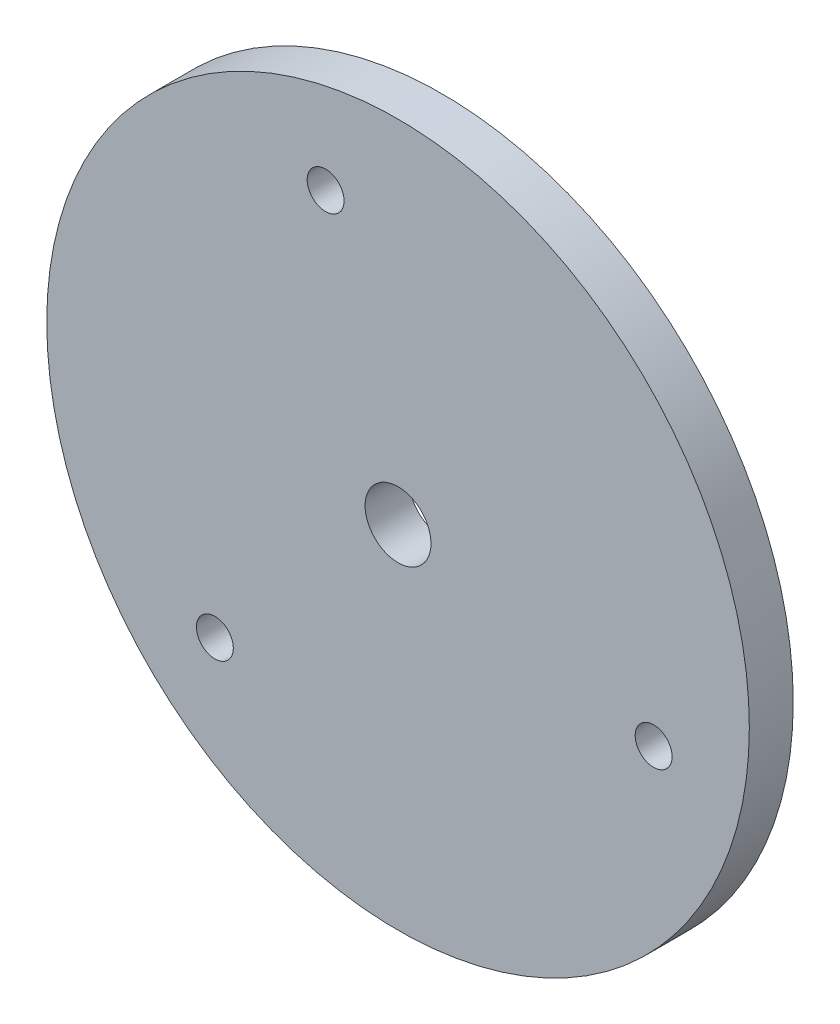
ISO-10303-21;
HEADER;
FILE_DESCRIPTION(('STEP AP214'),'2;1');
FILE_NAME('part.step','',(''),(''),'','','');
FILE_SCHEMA(('AUTOMOTIVE_DESIGN { 1 0 10303 214 1 1 1 1 }'));
ENDSEC;
DATA;
#1=APPLICATION_CONTEXT('core data for automotive mechanical design processes');
#2=APPLICATION_PROTOCOL_DEFINITION('international standard','automotive_design',2000,#1);
#3=PRODUCT_CONTEXT('',#1,'mechanical');
#4=PRODUCT('Part','Part','',(#3));
#5=PRODUCT_RELATED_PRODUCT_CATEGORY('part','',(#4));
#6=PRODUCT_DEFINITION_FORMATION('','',#4);
#7=PRODUCT_DEFINITION_CONTEXT('part definition',#1,'design');
#8=PRODUCT_DEFINITION('design','',#6,#7);
#9=PRODUCT_DEFINITION_SHAPE('','',#8);
#10=(LENGTH_UNIT() NAMED_UNIT(*) SI_UNIT(.MILLI.,.METRE.));
#11=(NAMED_UNIT(*) PLANE_ANGLE_UNIT() SI_UNIT($,.RADIAN.));
#12=(NAMED_UNIT(*) SI_UNIT($,.STERADIAN.) SOLID_ANGLE_UNIT());
#13=UNCERTAINTY_MEASURE_WITH_UNIT(LENGTH_MEASURE(1.E-05),#10,'distance_accuracy_value','');
#14=(GEOMETRIC_REPRESENTATION_CONTEXT(3) GLOBAL_UNCERTAINTY_ASSIGNED_CONTEXT((#13)) GLOBAL_UNIT_ASSIGNED_CONTEXT((#10,
#11,#12)) REPRESENTATION_CONTEXT('',''));
#15=CARTESIAN_POINT('',(0.,0.,0.));
#16=DIRECTION('',(0.,0.,1.));
#17=DIRECTION('',(1.,0.,0.));
#18=AXIS2_PLACEMENT_3D('',#15,#16,#17);
#19=CARTESIAN_POINT('',(0.,0.,6.35));
#20=DIRECTION('',(0.,0.,1.));
#21=DIRECTION('',(1.,0.,0.));
#22=AXIS2_PLACEMENT_3D('',#19,#20,#21);
#23=PLANE('',#22);
#24=CARTESIAN_POINT('',(-26.4884054457999,-27.3856600603111,6.35));
#25=DIRECTION('',(0.,0.,1.));
#26=DIRECTION('',(1.,0.,0.));
#27=AXIS2_PLACEMENT_3D('',#24,#25,#26);
#28=CIRCLE('',#27,2.667);
#29=CARTESIAN_POINT('',(-23.8214054457999,-27.3856600603111,6.35));
#30=VERTEX_POINT('',#29);
#31=EDGE_CURVE('E54',#30,#30,#28,.T.);
#32=ORIENTED_EDGE('',*,*,#31,.F.);
#33=EDGE_LOOP('',(#32));
#34=FACE_BOUND('',#33,.T.);
#35=CARTESIAN_POINT('',(-10.4724745887343,36.6324620519603,6.35));
#36=DIRECTION('',(0.,0.,1.));
#37=DIRECTION('',(1.,0.,0.));
#38=AXIS2_PLACEMENT_3D('',#35,#36,#37);
#39=CIRCLE('',#38,2.667);
#40=CARTESIAN_POINT('',(-7.80547458873433,36.6324620519603,6.35));
#41=VERTEX_POINT('',#40);
#42=EDGE_CURVE('E43',#41,#41,#39,.T.);
#43=ORIENTED_EDGE('',*,*,#42,.F.);
#44=EDGE_LOOP('',(#43));
#45=FACE_BOUND('',#44,.T.);
#46=CARTESIAN_POINT('',(0.,0.,6.35));
#47=DIRECTION('',(0.,0.,1.));
#48=DIRECTION('',(1.,0.,0.));
#49=AXIS2_PLACEMENT_3D('',#46,#47,#48);
#50=CIRCLE('',#49,50.8);
#51=CARTESIAN_POINT('',(50.8,0.,6.35));
#52=VERTEX_POINT('',#51);
#53=EDGE_CURVE('E10',#52,#52,#50,.T.);
#54=ORIENTED_EDGE('',*,*,#53,.T.);
#55=EDGE_LOOP('',(#54));
#56=FACE_BOUND('',#55,.T.);
#57=CARTESIAN_POINT('',(36.9608800345342,-9.24680199164924,6.35));
#58=DIRECTION('',(0.,0.,1.));
#59=DIRECTION('',(1.,0.,0.));
#60=AXIS2_PLACEMENT_3D('',#57,#58,#59);
#61=CIRCLE('',#60,2.667);
#62=CARTESIAN_POINT('',(39.6278800345342,-9.24680199164924,6.35));
#63=VERTEX_POINT('',#62);
#64=EDGE_CURVE('E48',#63,#63,#61,.T.);
#65=ORIENTED_EDGE('',*,*,#64,.F.);
#66=EDGE_LOOP('',(#65));
#67=FACE_BOUND('',#66,.T.);
#68=CARTESIAN_POINT('',(0.,0.,6.35));
#69=DIRECTION('',(0.,0.,1.));
#70=DIRECTION('',(1.,0.,0.));
#71=AXIS2_PLACEMENT_3D('',#68,#69,#70);
#72=CIRCLE('',#71,4.7625);
#73=CARTESIAN_POINT('',(4.7625,0.,6.35));
#74=VERTEX_POINT('',#73);
#75=EDGE_CURVE('E60',#74,#74,#72,.T.);
#76=ORIENTED_EDGE('',*,*,#75,.F.);
#77=EDGE_LOOP('',(#76));
#78=FACE_BOUND('',#77,.T.);
#79=ADVANCED_FACE('F32',(#34,#45,#56,#67,#78),#23,.T.);
#80=CARTESIAN_POINT('',(0.,0.,0.));
#81=DIRECTION('',(0.,0.,1.));
#82=DIRECTION('',(1.,0.,0.));
#83=AXIS2_PLACEMENT_3D('',#80,#81,#82);
#84=PLANE('',#83);
#85=CARTESIAN_POINT('',(0.,0.,0.));
#86=DIRECTION('',(0.,0.,1.));
#87=DIRECTION('',(1.,0.,0.));
#88=AXIS2_PLACEMENT_3D('',#85,#86,#87);
#89=CIRCLE('',#88,50.8);
#90=CARTESIAN_POINT('',(50.8,0.,0.));
#91=VERTEX_POINT('',#90);
#92=EDGE_CURVE('E36',#91,#91,#89,.T.);
#93=ORIENTED_EDGE('',*,*,#92,.F.);
#94=EDGE_LOOP('',(#93));
#95=FACE_BOUND('',#94,.T.);
#96=CARTESIAN_POINT('',(-10.4724745887343,36.6324620519603,0.));
#97=DIRECTION('',(0.,0.,1.));
#98=DIRECTION('',(1.,0.,0.));
#99=AXIS2_PLACEMENT_3D('',#96,#97,#98);
#100=CIRCLE('',#99,2.667);
#101=CARTESIAN_POINT('',(-7.80547458873433,36.6324620519603,0.));
#102=VERTEX_POINT('',#101);
#103=EDGE_CURVE('E45',#102,#102,#100,.T.);
#104=ORIENTED_EDGE('',*,*,#103,.T.);
#105=EDGE_LOOP('',(#104));
#106=FACE_BOUND('',#105,.T.);
#107=CARTESIAN_POINT('',(36.9608800345342,-9.24680199164924,0.));
#108=DIRECTION('',(0.,0.,1.));
#109=DIRECTION('',(1.,0.,0.));
#110=AXIS2_PLACEMENT_3D('',#107,#108,#109);
#111=CIRCLE('',#110,2.667);
#112=CARTESIAN_POINT('',(39.6278800345342,-9.24680199164924,0.));
#113=VERTEX_POINT('',#112);
#114=EDGE_CURVE('E51',#113,#113,#111,.T.);
#115=ORIENTED_EDGE('',*,*,#114,.T.);
#116=EDGE_LOOP('',(#115));
#117=FACE_BOUND('',#116,.T.);
#118=CARTESIAN_POINT('',(-26.4884054457999,-27.3856600603111,0.));
#119=DIRECTION('',(0.,0.,1.));
#120=DIRECTION('',(1.,0.,0.));
#121=AXIS2_PLACEMENT_3D('',#118,#119,#120);
#122=CIRCLE('',#121,2.667);
#123=CARTESIAN_POINT('',(-23.8214054457999,-27.3856600603111,0.));
#124=VERTEX_POINT('',#123);
#125=EDGE_CURVE('E57',#124,#124,#122,.T.);
#126=ORIENTED_EDGE('',*,*,#125,.T.);
#127=EDGE_LOOP('',(#126));
#128=FACE_BOUND('',#127,.T.);
#129=CARTESIAN_POINT('',(0.,0.,0.));
#130=DIRECTION('',(0.,0.,1.));
#131=DIRECTION('',(1.,0.,0.));
#132=AXIS2_PLACEMENT_3D('',#129,#130,#131);
#133=CIRCLE('',#132,4.7625);
#134=CARTESIAN_POINT('',(4.7625,0.,0.));
#135=VERTEX_POINT('',#134);
#136=EDGE_CURVE('E63',#135,#135,#133,.T.);
#137=ORIENTED_EDGE('',*,*,#136,.T.);
#138=EDGE_LOOP('',(#137));
#139=FACE_BOUND('',#138,.T.);
#140=ADVANCED_FACE('F73',(#95,#106,#117,#128,#139),#84,.F.);
#141=CARTESIAN_POINT('',(0.,0.,6.35));
#142=DIRECTION('',(0.,0.,-1.));
#143=DIRECTION('',(-1.,0.,0.));
#144=AXIS2_PLACEMENT_3D('',#141,#142,#143);
#145=CYLINDRICAL_SURFACE('',#144,50.8);
#146=ORIENTED_EDGE('',*,*,#53,.F.);
#147=EDGE_LOOP('',(#146));
#148=FACE_BOUND('',#147,.T.);
#149=ORIENTED_EDGE('',*,*,#92,.T.);
#150=EDGE_LOOP('',(#149));
#151=FACE_BOUND('',#150,.T.);
#152=ADVANCED_FACE('F34',(#148,#151),#145,.T.);
#153=CARTESIAN_POINT('',(-10.4724745887343,36.6324620519603,6.35));
#154=DIRECTION('',(0.,0.,-1.));
#155=DIRECTION('',(-1.,0.,0.));
#156=AXIS2_PLACEMENT_3D('',#153,#154,#155);
#157=CYLINDRICAL_SURFACE('',#156,2.667);
#158=ORIENTED_EDGE('',*,*,#42,.T.);
#159=EDGE_LOOP('',(#158));
#160=FACE_BOUND('',#159,.T.);
#161=ORIENTED_EDGE('',*,*,#103,.F.);
#162=EDGE_LOOP('',(#161));
#163=FACE_BOUND('',#162,.T.);
#164=ADVANCED_FACE('F83',(#160,#163),#157,.F.);
#165=CARTESIAN_POINT('',(36.9608800345342,-9.24680199164924,6.35));
#166=DIRECTION('',(0.,0.,-1.));
#167=DIRECTION('',(-1.,0.,0.));
#168=AXIS2_PLACEMENT_3D('',#165,#166,#167);
#169=CYLINDRICAL_SURFACE('',#168,2.667);
#170=ORIENTED_EDGE('',*,*,#64,.T.);
#171=EDGE_LOOP('',(#170));
#172=FACE_BOUND('',#171,.T.);
#173=ORIENTED_EDGE('',*,*,#114,.F.);
#174=EDGE_LOOP('',(#173));
#175=FACE_BOUND('',#174,.T.);
#176=ADVANCED_FACE('F86',(#172,#175),#169,.F.);
#177=CARTESIAN_POINT('',(-26.4884054457999,-27.3856600603111,6.35));
#178=DIRECTION('',(0.,0.,-1.));
#179=DIRECTION('',(-1.,0.,0.));
#180=AXIS2_PLACEMENT_3D('',#177,#178,#179);
#181=CYLINDRICAL_SURFACE('',#180,2.667);
#182=ORIENTED_EDGE('',*,*,#31,.T.);
#183=EDGE_LOOP('',(#182));
#184=FACE_BOUND('',#183,.T.);
#185=ORIENTED_EDGE('',*,*,#125,.F.);
#186=EDGE_LOOP('',(#185));
#187=FACE_BOUND('',#186,.T.);
#188=ADVANCED_FACE('F90',(#184,#187),#181,.F.);
#189=CARTESIAN_POINT('',(0.,0.,6.35));
#190=DIRECTION('',(0.,0.,-1.));
#191=DIRECTION('',(-1.,0.,0.));
#192=AXIS2_PLACEMENT_3D('',#189,#190,#191);
#193=CYLINDRICAL_SURFACE('',#192,4.7625);
#194=ORIENTED_EDGE('',*,*,#75,.T.);
#195=EDGE_LOOP('',(#194));
#196=FACE_BOUND('',#195,.T.);
#197=ORIENTED_EDGE('',*,*,#136,.F.);
#198=EDGE_LOOP('',(#197));
#199=FACE_BOUND('',#198,.T.);
#200=ADVANCED_FACE('F69',(#196,#199),#193,.F.);
#201=CLOSED_SHELL('',(#79,#140,#152,#164,#176,#188,#200));
#202=MANIFOLD_SOLID_BREP('B2',#201);
#203=ADVANCED_BREP_SHAPE_REPRESENTATION('',(#18,#202),#14);
#204=SHAPE_DEFINITION_REPRESENTATION(#9,#203);
ENDSEC;
END-ISO-10303-21;
